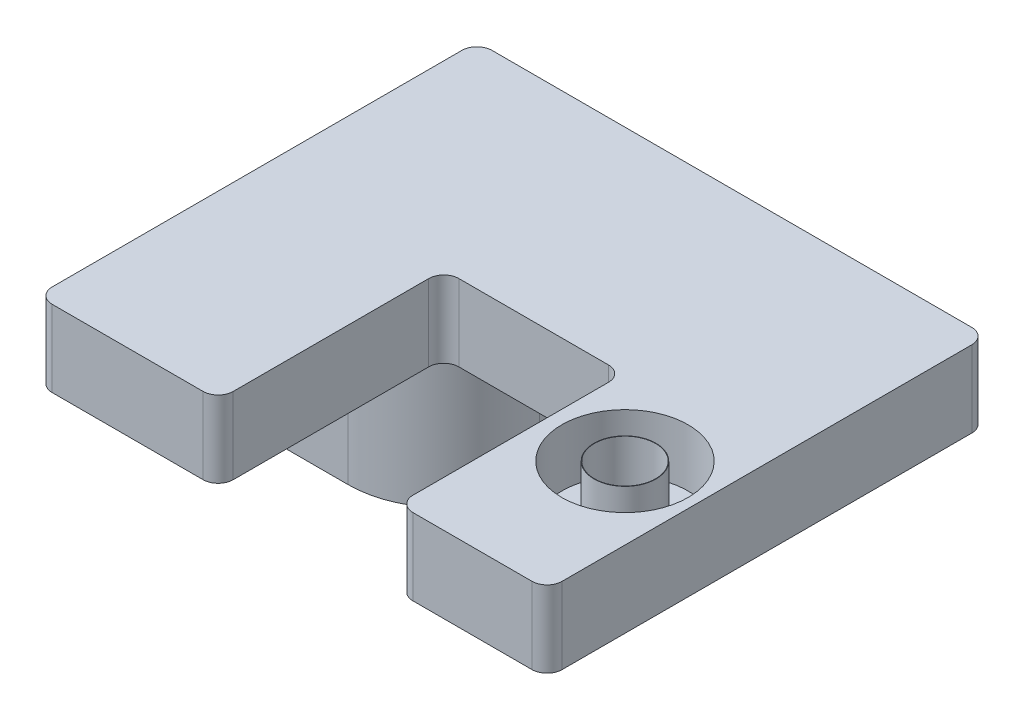
ISO-10303-21;
HEADER;
FILE_DESCRIPTION(('STEP AP214'),'2;1');
FILE_NAME('part.step','',(''),(''),'','','');
FILE_SCHEMA(('AUTOMOTIVE_DESIGN { 1 0 10303 214 1 1 1 1 }'));
ENDSEC;
DATA;
#1=APPLICATION_CONTEXT('core data for automotive mechanical design processes');
#2=APPLICATION_PROTOCOL_DEFINITION('international standard','automotive_design',2000,#1);
#3=PRODUCT_CONTEXT('',#1,'mechanical');
#4=PRODUCT('Part','Part','',(#3));
#5=PRODUCT_RELATED_PRODUCT_CATEGORY('part','',(#4));
#6=PRODUCT_DEFINITION_FORMATION('','',#4);
#7=PRODUCT_DEFINITION_CONTEXT('part definition',#1,'design');
#8=PRODUCT_DEFINITION('design','',#6,#7);
#9=PRODUCT_DEFINITION_SHAPE('','',#8);
#10=(LENGTH_UNIT() NAMED_UNIT(*) SI_UNIT(.MILLI.,.METRE.));
#11=(NAMED_UNIT(*) PLANE_ANGLE_UNIT() SI_UNIT($,.RADIAN.));
#12=(NAMED_UNIT(*) SI_UNIT($,.STERADIAN.) SOLID_ANGLE_UNIT());
#13=UNCERTAINTY_MEASURE_WITH_UNIT(LENGTH_MEASURE(1.E-05),#10,'distance_accuracy_value','');
#14=(GEOMETRIC_REPRESENTATION_CONTEXT(3) GLOBAL_UNCERTAINTY_ASSIGNED_CONTEXT((#13)) GLOBAL_UNIT_ASSIGNED_CONTEXT((#10,
#11,#12)) REPRESENTATION_CONTEXT('',''));
#15=CARTESIAN_POINT('',(0.,0.,0.));
#16=DIRECTION('',(0.,0.,1.));
#17=DIRECTION('',(1.,0.,0.));
#18=AXIS2_PLACEMENT_3D('',#15,#16,#17);
#19=CARTESIAN_POINT('',(0.,0.,0.));
#20=DIRECTION('',(0.,1.,0.));
#21=DIRECTION('',(0.,0.,1.));
#22=AXIS2_PLACEMENT_3D('',#19,#20,#21);
#23=PLANE('',#22);
#24=CARTESIAN_POINT('',(29.0406666666667,0.,-10.));
#25=DIRECTION('',(0.,1.,0.));
#26=DIRECTION('',(0.,0.,1.));
#27=AXIS2_PLACEMENT_3D('',#24,#25,#26);
#28=CIRCLE('',#27,2.032);
#29=CARTESIAN_POINT('',(29.0406666666667,0.,-7.968));
#30=VERTEX_POINT('',#29);
#31=EDGE_CURVE('E250',#30,#30,#28,.T.);
#32=ORIENTED_EDGE('',*,*,#31,.T.);
#33=EDGE_LOOP('',(#32));
#34=FACE_BOUND('',#33,.T.);
#35=DIRECTION('',(-1.,0.,0.));
#36=VECTOR('',#35,1.);
#37=CARTESIAN_POINT('',(5.96555988548007,0.,-14.6931067811865));
#38=LINE('',#37,#36);
#39=CARTESIAN_POINT('',(5.96555988548007,0.,-14.6931067811865));
#40=VERTEX_POINT('',#39);
#41=CARTESIAN_POINT('',(0.,0.,-14.6931067811865));
#42=VERTEX_POINT('',#41);
#43=EDGE_CURVE('E56',#40,#42,#38,.T.);
#44=ORIENTED_EDGE('',*,*,#43,.F.);
#45=CARTESIAN_POINT('',(5.96555988548012,0.,-21.0431067811865));
#46=DIRECTION('',(0.,-1.,0.));
#47=DIRECTION('',(0.,0.,-1.));
#48=AXIS2_PLACEMENT_3D('',#45,#46,#47);
#49=CIRCLE('',#48,6.35);
#50=CARTESIAN_POINT('',(12.3155598854801,0.,-21.0431067811866));
#51=VERTEX_POINT('',#50);
#52=EDGE_CURVE('E203',#51,#40,#49,.T.);
#53=ORIENTED_EDGE('',*,*,#52,.F.);
#54=DIRECTION('',(0.,0.,1.));
#55=VECTOR('',#54,1.);
#56=CARTESIAN_POINT('',(12.3155598854801,0.,-29.21));
#57=LINE('',#56,#55);
#58=CARTESIAN_POINT('',(12.3155598854801,0.,-29.21));
#59=VERTEX_POINT('',#58);
#60=EDGE_CURVE('E62',#59,#51,#57,.T.);
#61=ORIENTED_EDGE('',*,*,#60,.F.);
#62=DIRECTION('',(1.,0.,0.));
#63=VECTOR('',#62,1.);
#64=CARTESIAN_POINT('',(0.,0.,-29.21));
#65=LINE('',#64,#63);
#66=CARTESIAN_POINT('',(32.8666666666667,0.,-29.21));
#67=VERTEX_POINT('',#66);
#68=EDGE_CURVE('E286',#59,#67,#65,.T.);
#69=ORIENTED_EDGE('',*,*,#68,.T.);
#70=CARTESIAN_POINT('',(32.8666666666667,0.,-28.21));
#71=DIRECTION('',(0.,1.,0.));
#72=DIRECTION('',(0.,0.,1.));
#73=AXIS2_PLACEMENT_3D('',#70,#71,#72);
#74=CIRCLE('',#73,1.);
#75=CARTESIAN_POINT('',(33.8666666666667,0.,-28.21));
#76=VERTEX_POINT('',#75);
#77=EDGE_CURVE('E316',#67,#76,#74,.F.);
#78=ORIENTED_EDGE('',*,*,#77,.T.);
#79=DIRECTION('',(0.,0.,-1.));
#80=VECTOR('',#79,1.);
#81=CARTESIAN_POINT('',(33.8666666666667,0.,0.));
#82=LINE('',#81,#80);
#83=CARTESIAN_POINT('',(33.8666666666667,0.,-1.));
#84=VERTEX_POINT('',#83);
#85=EDGE_CURVE('E282',#84,#76,#82,.T.);
#86=ORIENTED_EDGE('',*,*,#85,.F.);
#87=CARTESIAN_POINT('',(32.8666666666667,0.,-1.));
#88=DIRECTION('',(0.,1.,0.));
#89=DIRECTION('',(0.,0.,1.));
#90=AXIS2_PLACEMENT_3D('',#87,#88,#89);
#91=CIRCLE('',#90,1.);
#92=CARTESIAN_POINT('',(32.8666666666667,0.,0.));
#93=VERTEX_POINT('',#92);
#94=EDGE_CURVE('E314',#84,#93,#91,.F.);
#95=ORIENTED_EDGE('',*,*,#94,.T.);
#96=DIRECTION('',(1.,0.,0.));
#97=VECTOR('',#96,1.);
#98=CARTESIAN_POINT('',(0.,0.,0.));
#99=LINE('',#98,#97);
#100=CARTESIAN_POINT('',(24.9606666666667,0.,0.));
#101=VERTEX_POINT('',#100);
#102=EDGE_CURVE('E279',#101,#93,#99,.T.);
#103=ORIENTED_EDGE('',*,*,#102,.F.);
#104=CARTESIAN_POINT('',(24.9606666666667,0.,-1.));
#105=DIRECTION('',(0.,1.,0.));
#106=DIRECTION('',(0.,0.,1.));
#107=AXIS2_PLACEMENT_3D('',#104,#105,#106);
#108=CIRCLE('',#107,1.);
#109=CARTESIAN_POINT('',(23.9606666666667,0.,-1.));
#110=VERTEX_POINT('',#109);
#111=EDGE_CURVE('E312',#101,#110,#108,.F.);
#112=ORIENTED_EDGE('',*,*,#111,.T.);
#113=DIRECTION('',(0.,0.,-1.));
#114=VECTOR('',#113,1.);
#115=CARTESIAN_POINT('',(23.9606666666667,0.,0.));
#116=LINE('',#115,#114);
#117=CARTESIAN_POINT('',(23.9606666666667,0.,-13.986));
#118=VERTEX_POINT('',#117);
#119=EDGE_CURVE('E276',#110,#118,#116,.T.);
#120=ORIENTED_EDGE('',*,*,#119,.T.);
#121=CARTESIAN_POINT('',(22.9606666666667,0.,-13.986));
#122=DIRECTION('',(0.,1.,0.));
#123=DIRECTION('',(0.,0.,1.));
#124=AXIS2_PLACEMENT_3D('',#121,#122,#123);
#125=CIRCLE('',#124,1.);
#126=CARTESIAN_POINT('',(22.9606666666667,0.,-14.986));
#127=VERTEX_POINT('',#126);
#128=EDGE_CURVE('E360',#118,#127,#125,.T.);
#129=ORIENTED_EDGE('',*,*,#128,.T.);
#130=DIRECTION('',(1.,0.,0.));
#131=VECTOR('',#130,1.);
#132=CARTESIAN_POINT('',(0.,0.,-14.986));
#133=LINE('',#132,#131);
#134=CARTESIAN_POINT('',(13.0226666666667,0.,-14.986));
#135=VERTEX_POINT('',#134);
#136=EDGE_CURVE('E255',#135,#127,#133,.T.);
#137=ORIENTED_EDGE('',*,*,#136,.F.);
#138=CARTESIAN_POINT('',(13.0226666666667,0.,-13.986));
#139=DIRECTION('',(0.,1.,0.));
#140=DIRECTION('',(0.,0.,1.));
#141=AXIS2_PLACEMENT_3D('',#138,#139,#140);
#142=CIRCLE('',#141,1.);
#143=CARTESIAN_POINT('',(12.0226666666667,0.,-13.986));
#144=VERTEX_POINT('',#143);
#145=EDGE_CURVE('E48',#135,#144,#142,.T.);
#146=ORIENTED_EDGE('',*,*,#145,.T.);
#147=DIRECTION('',(0.,0.,-1.));
#148=VECTOR('',#147,1.);
#149=CARTESIAN_POINT('',(12.0226666666667,0.,0.));
#150=LINE('',#149,#148);
#151=CARTESIAN_POINT('',(12.0226666666667,0.,-1.));
#152=VERTEX_POINT('',#151);
#153=EDGE_CURVE('E367',#152,#144,#150,.T.);
#154=ORIENTED_EDGE('',*,*,#153,.F.);
#155=CARTESIAN_POINT('',(11.0226666666667,0.,-1.));
#156=DIRECTION('',(0.,1.,0.));
#157=DIRECTION('',(0.,0.,1.));
#158=AXIS2_PLACEMENT_3D('',#155,#156,#157);
#159=CIRCLE('',#158,1.);
#160=CARTESIAN_POINT('',(11.0226666666667,0.,0.));
#161=VERTEX_POINT('',#160);
#162=EDGE_CURVE('E306',#152,#161,#159,.F.);
#163=ORIENTED_EDGE('',*,*,#162,.T.);
#164=CARTESIAN_POINT('',(1.,0.,0.));
#165=VERTEX_POINT('',#164);
#166=EDGE_CURVE('E283',#165,#161,#99,.T.);
#167=ORIENTED_EDGE('',*,*,#166,.F.);
#168=CARTESIAN_POINT('',(1.,0.,-1.));
#169=DIRECTION('',(0.,1.,0.));
#170=DIRECTION('',(0.,0.,1.));
#171=AXIS2_PLACEMENT_3D('',#168,#169,#170);
#172=CIRCLE('',#171,1.);
#173=CARTESIAN_POINT('',(0.,0.,-1.));
#174=VERTEX_POINT('',#173);
#175=EDGE_CURVE('E304',#165,#174,#172,.F.);
#176=ORIENTED_EDGE('',*,*,#175,.T.);
#177=DIRECTION('',(0.,0.,-1.));
#178=VECTOR('',#177,1.);
#179=CARTESIAN_POINT('',(0.,0.,0.));
#180=LINE('',#179,#178);
#181=EDGE_CURVE('E294',#174,#42,#180,.T.);
#182=ORIENTED_EDGE('',*,*,#181,.T.);
#183=EDGE_LOOP('',(#44,#53,#61,#69,#78,#86,#95,#103,#112,#120,#129,#137,#146,#154,#163,#167,
#176,#182));
#184=FACE_BOUND('',#183,.T.);
#185=ADVANCED_FACE('F39',(#34,#184),#23,.F.);
#186=CARTESIAN_POINT('',(0.,1.27,0.));
#187=DIRECTION('',(0.,1.,0.));
#188=DIRECTION('',(0.,0.,1.));
#189=AXIS2_PLACEMENT_3D('',#186,#187,#188);
#190=PLANE('',#189);
#191=CARTESIAN_POINT('',(29.0406666666667,1.27,-10.));
#192=DIRECTION('',(0.,1.,0.));
#193=DIRECTION('',(0.,0.,1.));
#194=AXIS2_PLACEMENT_3D('',#191,#192,#193);
#195=CIRCLE('',#194,4.191);
#196=CARTESIAN_POINT('',(29.0406666666667,1.27,-5.809));
#197=VERTEX_POINT('',#196);
#198=EDGE_CURVE('E247',#197,#197,#195,.F.);
#199=ORIENTED_EDGE('',*,*,#198,.F.);
#200=EDGE_LOOP('',(#199));
#201=FACE_BOUND('',#200,.T.);
#202=CARTESIAN_POINT('',(29.0406666666667,1.27,-10.));
#203=DIRECTION('',(0.,1.,0.));
#204=DIRECTION('',(0.,0.,1.));
#205=AXIS2_PLACEMENT_3D('',#202,#203,#204);
#206=CIRCLE('',#205,2.0574);
#207=CARTESIAN_POINT('',(29.0406666666667,1.27,-7.9426));
#208=VERTEX_POINT('',#207);
#209=EDGE_CURVE('E240',#208,#208,#206,.T.);
#210=ORIENTED_EDGE('',*,*,#209,.F.);
#211=EDGE_LOOP('',(#210));
#212=FACE_BOUND('',#211,.T.);
#213=ADVANCED_FACE('F438',(#201,#212),#190,.T.);
#214=CARTESIAN_POINT('',(29.0406666666667,5.08,-10.));
#215=DIRECTION('',(0.,-1.,0.));
#216=DIRECTION('',(0.,0.,-1.));
#217=AXIS2_PLACEMENT_3D('',#214,#215,#216);
#218=CYLINDRICAL_SURFACE('',#217,2.032);
#219=ORIENTED_EDGE('',*,*,#31,.F.);
#220=EDGE_LOOP('',(#219));
#221=FACE_BOUND('',#220,.T.);
#222=CARTESIAN_POINT('',(29.0406666666667,5.08,-10.));
#223=DIRECTION('',(0.,1.,0.));
#224=DIRECTION('',(0.,0.,1.));
#225=AXIS2_PLACEMENT_3D('',#222,#223,#224);
#226=CIRCLE('',#225,2.032);
#227=CARTESIAN_POINT('',(29.0406666666667,5.08,-7.968));
#228=VERTEX_POINT('',#227);
#229=EDGE_CURVE('E234',#228,#228,#226,.T.);
#230=ORIENTED_EDGE('',*,*,#229,.T.);
#231=EDGE_LOOP('',(#230));
#232=FACE_BOUND('',#231,.T.);
#233=ADVANCED_FACE('F444',(#221,#232),#218,.F.);
#234=CARTESIAN_POINT('',(23.9606666666667,5.08,0.));
#235=DIRECTION('',(-1.,0.,0.));
#236=DIRECTION('',(0.,0.,1.));
#237=AXIS2_PLACEMENT_3D('',#234,#235,#236);
#238=PLANE('',#237);
#239=ORIENTED_EDGE('',*,*,#119,.F.);
#240=DIRECTION('',(0.,-1.,0.));
#241=VECTOR('',#240,1.);
#242=CARTESIAN_POINT('',(23.9606666666667,5.08,-1.));
#243=LINE('',#242,#241);
#244=CARTESIAN_POINT('',(23.9606666666667,5.08,-1.));
#245=VERTEX_POINT('',#244);
#246=EDGE_CURVE('E343',#110,#245,#243,.F.);
#247=ORIENTED_EDGE('',*,*,#246,.T.);
#248=DIRECTION('',(0.,0.,-1.));
#249=VECTOR('',#248,1.);
#250=CARTESIAN_POINT('',(23.9606666666667,5.08,0.));
#251=LINE('',#250,#249);
#252=CARTESIAN_POINT('',(23.9606666666667,5.08,-13.986));
#253=VERTEX_POINT('',#252);
#254=EDGE_CURVE('E251',#245,#253,#251,.T.);
#255=ORIENTED_EDGE('',*,*,#254,.T.);
#256=DIRECTION('',(0.,-1.,0.));
#257=VECTOR('',#256,1.);
#258=CARTESIAN_POINT('',(23.9606666666667,5.08,-13.986));
#259=LINE('',#258,#257);
#260=EDGE_CURVE('E340',#253,#118,#259,.T.);
#261=ORIENTED_EDGE('',*,*,#260,.T.);
#262=EDGE_LOOP('',(#239,#247,#255,#261));
#263=FACE_BOUND('',#262,.T.);
#264=ADVANCED_FACE('F392',(#263),#238,.T.);
#265=CARTESIAN_POINT('',(0.,5.08,0.));
#266=DIRECTION('',(0.,0.,-1.));
#267=DIRECTION('',(-1.,0.,0.));
#268=AXIS2_PLACEMENT_3D('',#265,#266,#267);
#269=PLANE('',#268);
#270=ORIENTED_EDGE('',*,*,#102,.T.);
#271=DIRECTION('',(0.,-1.,0.));
#272=VECTOR('',#271,1.);
#273=CARTESIAN_POINT('',(32.8666666666667,5.08,0.));
#274=LINE('',#273,#272);
#275=CARTESIAN_POINT('',(32.8666666666667,5.08,0.));
#276=VERTEX_POINT('',#275);
#277=EDGE_CURVE('E338',#93,#276,#274,.F.);
#278=ORIENTED_EDGE('',*,*,#277,.T.);
#279=DIRECTION('',(1.,0.,0.));
#280=VECTOR('',#279,1.);
#281=CARTESIAN_POINT('',(0.,5.08,0.));
#282=LINE('',#281,#280);
#283=CARTESIAN_POINT('',(24.9606666666667,5.08,0.));
#284=VERTEX_POINT('',#283);
#285=EDGE_CURVE('E254',#284,#276,#282,.T.);
#286=ORIENTED_EDGE('',*,*,#285,.F.);
#287=DIRECTION('',(0.,-1.,0.));
#288=VECTOR('',#287,1.);
#289=CARTESIAN_POINT('',(24.9606666666667,0.,0.));
#290=LINE('',#289,#288);
#291=EDGE_CURVE('E335',#284,#101,#290,.T.);
#292=ORIENTED_EDGE('',*,*,#291,.T.);
#293=EDGE_LOOP('',(#270,#278,#286,#292));
#294=FACE_BOUND('',#293,.T.);
#295=ADVANCED_FACE('F401',(#294),#269,.F.);
#296=CARTESIAN_POINT('',(33.8666666666667,5.08,0.));
#297=DIRECTION('',(-1.,0.,0.));
#298=DIRECTION('',(0.,0.,1.));
#299=AXIS2_PLACEMENT_3D('',#296,#297,#298);
#300=PLANE('',#299);
#301=ORIENTED_EDGE('',*,*,#85,.T.);
#302=DIRECTION('',(0.,-1.,0.));
#303=VECTOR('',#302,1.);
#304=CARTESIAN_POINT('',(33.8666666666667,5.08,-28.21));
#305=LINE('',#304,#303);
#306=CARTESIAN_POINT('',(33.8666666666667,5.08,-28.21));
#307=VERTEX_POINT('',#306);
#308=EDGE_CURVE('E333',#76,#307,#305,.F.);
#309=ORIENTED_EDGE('',*,*,#308,.T.);
#310=DIRECTION('',(0.,0.,-1.));
#311=VECTOR('',#310,1.);
#312=CARTESIAN_POINT('',(33.8666666666667,5.08,0.));
#313=LINE('',#312,#311);
#314=CARTESIAN_POINT('',(33.8666666666667,5.08,-1.));
#315=VERTEX_POINT('',#314);
#316=EDGE_CURVE('E261',#315,#307,#313,.T.);
#317=ORIENTED_EDGE('',*,*,#316,.F.);
#318=DIRECTION('',(0.,-1.,0.));
#319=VECTOR('',#318,1.);
#320=CARTESIAN_POINT('',(33.8666666666667,5.08,-1.));
#321=LINE('',#320,#319);
#322=EDGE_CURVE('E330',#315,#84,#321,.T.);
#323=ORIENTED_EDGE('',*,*,#322,.T.);
#324=EDGE_LOOP('',(#301,#309,#317,#323));
#325=FACE_BOUND('',#324,.T.);
#326=ADVANCED_FACE('F410',(#325),#300,.F.);
#327=CARTESIAN_POINT('',(0.,5.08,-29.21));
#328=DIRECTION('',(0.,0.,-1.));
#329=DIRECTION('',(-1.,0.,0.));
#330=AXIS2_PLACEMENT_3D('',#327,#328,#329);
#331=PLANE('',#330);
#332=ORIENTED_EDGE('',*,*,#68,.F.);
#333=DIRECTION('',(0.,1.,0.));
#334=VECTOR('',#333,1.);
#335=CARTESIAN_POINT('',(12.3155598854801,-10.16,-29.21));
#336=LINE('',#335,#334);
#337=CARTESIAN_POINT('',(12.3155598854801,-10.16,-29.21));
#338=VERTEX_POINT('',#337);
#339=EDGE_CURVE('E193',#338,#59,#336,.T.);
#340=ORIENTED_EDGE('',*,*,#339,.F.);
#341=DIRECTION('',(1.,0.,0.));
#342=VECTOR('',#341,1.);
#343=CARTESIAN_POINT('',(0.999999999999993,-10.16,-29.21));
#344=LINE('',#343,#342);
#345=CARTESIAN_POINT('',(0.999999999999993,-10.16,-29.21));
#346=VERTEX_POINT('',#345);
#347=EDGE_CURVE('E190',#346,#338,#344,.T.);
#348=ORIENTED_EDGE('',*,*,#347,.F.);
#349=DIRECTION('',(0.,-1.,0.));
#350=VECTOR('',#349,1.);
#351=CARTESIAN_POINT('',(0.999999999999993,5.08,-29.21));
#352=LINE('',#351,#350);
#353=CARTESIAN_POINT('',(0.999999999999993,5.08,-29.21));
#354=VERTEX_POINT('',#353);
#355=EDGE_CURVE('E176',#346,#354,#352,.F.);
#356=ORIENTED_EDGE('',*,*,#355,.T.);
#357=DIRECTION('',(1.,0.,0.));
#358=VECTOR('',#357,1.);
#359=CARTESIAN_POINT('',(0.,5.08,-29.21));
#360=LINE('',#359,#358);
#361=CARTESIAN_POINT('',(32.8666666666667,5.08,-29.21));
#362=VERTEX_POINT('',#361);
#363=EDGE_CURVE('E264',#354,#362,#360,.T.);
#364=ORIENTED_EDGE('',*,*,#363,.T.);
#365=DIRECTION('',(0.,-1.,0.));
#366=VECTOR('',#365,1.);
#367=CARTESIAN_POINT('',(32.8666666666667,0.,-29.21));
#368=LINE('',#367,#366);
#369=EDGE_CURVE('E187',#362,#67,#368,.T.);
#370=ORIENTED_EDGE('',*,*,#369,.T.);
#371=EDGE_LOOP('',(#332,#340,#348,#356,#364,#370));
#372=FACE_BOUND('',#371,.T.);
#373=ADVANCED_FACE('F191',(#372),#331,.T.);
#374=CARTESIAN_POINT('',(0.,5.08,0.));
#375=DIRECTION('',(-1.,0.,0.));
#376=DIRECTION('',(0.,0.,1.));
#377=AXIS2_PLACEMENT_3D('',#374,#375,#376);
#378=PLANE('',#377);
#379=DIRECTION('',(0.,0.,-1.));
#380=VECTOR('',#379,1.);
#381=CARTESIAN_POINT('',(0.,5.08,0.));
#382=LINE('',#381,#380);
#383=CARTESIAN_POINT('',(0.,5.08,-1.));
#384=VERTEX_POINT('',#383);
#385=CARTESIAN_POINT('',(0.,5.08,-28.21));
#386=VERTEX_POINT('',#385);
#387=EDGE_CURVE('E260',#384,#386,#382,.T.);
#388=ORIENTED_EDGE('',*,*,#387,.T.);
#389=DIRECTION('',(0.,-1.,0.));
#390=VECTOR('',#389,1.);
#391=CARTESIAN_POINT('',(0.,5.08,-28.21));
#392=LINE('',#391,#390);
#393=CARTESIAN_POINT('',(0.,-10.16,-28.21));
#394=VERTEX_POINT('',#393);
#395=EDGE_CURVE('E302',#386,#394,#392,.T.);
#396=ORIENTED_EDGE('',*,*,#395,.T.);
#397=DIRECTION('',(0.,0.,-1.));
#398=VECTOR('',#397,1.);
#399=CARTESIAN_POINT('',(0.,-10.16,-14.6931067811865));
#400=LINE('',#399,#398);
#401=CARTESIAN_POINT('',(0.,-10.16,-14.6931067811865));
#402=VERTEX_POINT('',#401);
#403=EDGE_CURVE('E201',#402,#394,#400,.T.);
#404=ORIENTED_EDGE('',*,*,#403,.F.);
#405=DIRECTION('',(0.,1.,0.));
#406=VECTOR('',#405,1.);
#407=CARTESIAN_POINT('',(0.,-10.16,-14.6931067811865));
#408=LINE('',#407,#406);
#409=EDGE_CURVE('E212',#402,#42,#408,.T.);
#410=ORIENTED_EDGE('',*,*,#409,.T.);
#411=ORIENTED_EDGE('',*,*,#181,.F.);
#412=DIRECTION('',(0.,-1.,0.));
#413=VECTOR('',#412,1.);
#414=CARTESIAN_POINT('',(0.,5.08,-1.));
#415=LINE('',#414,#413);
#416=EDGE_CURVE('E273',#174,#384,#415,.F.);
#417=ORIENTED_EDGE('',*,*,#416,.T.);
#418=EDGE_LOOP('',(#388,#396,#404,#410,#411,#417));
#419=FACE_BOUND('',#418,.T.);
#420=ADVANCED_FACE('F301',(#419),#378,.T.);
#421=ORIENTED_EDGE('',*,*,#166,.T.);
#422=DIRECTION('',(0.,-1.,0.));
#423=VECTOR('',#422,1.);
#424=CARTESIAN_POINT('',(11.0226666666667,5.08,0.));
#425=LINE('',#424,#423);
#426=CARTESIAN_POINT('',(11.0226666666667,5.08,0.));
#427=VERTEX_POINT('',#426);
#428=EDGE_CURVE('E358',#161,#427,#425,.F.);
#429=ORIENTED_EDGE('',*,*,#428,.T.);
#430=CARTESIAN_POINT('',(1.,5.08,0.));
#431=VERTEX_POINT('',#430);
#432=EDGE_CURVE('E256',#431,#427,#282,.T.);
#433=ORIENTED_EDGE('',*,*,#432,.F.);
#434=DIRECTION('',(0.,-1.,0.));
#435=VECTOR('',#434,1.);
#436=CARTESIAN_POINT('',(1.,0.,0.));
#437=LINE('',#436,#435);
#438=EDGE_CURVE('E355',#431,#165,#437,.T.);
#439=ORIENTED_EDGE('',*,*,#438,.T.);
#440=EDGE_LOOP('',(#421,#429,#433,#439));
#441=FACE_BOUND('',#440,.T.);
#442=ADVANCED_FACE('F425',(#441),#269,.F.);
#443=CARTESIAN_POINT('',(12.0226666666667,5.08,0.));
#444=DIRECTION('',(-1.,0.,0.));
#445=DIRECTION('',(0.,0.,1.));
#446=AXIS2_PLACEMENT_3D('',#443,#444,#445);
#447=PLANE('',#446);
#448=ORIENTED_EDGE('',*,*,#153,.T.);
#449=DIRECTION('',(0.,-1.,0.));
#450=VECTOR('',#449,1.);
#451=CARTESIAN_POINT('',(12.0226666666667,5.08,-13.986));
#452=LINE('',#451,#450);
#453=CARTESIAN_POINT('',(12.0226666666667,5.08,-13.986));
#454=VERTEX_POINT('',#453);
#455=EDGE_CURVE('E353',#144,#454,#452,.F.);
#456=ORIENTED_EDGE('',*,*,#455,.T.);
#457=DIRECTION('',(0.,0.,-1.));
#458=VECTOR('',#457,1.);
#459=CARTESIAN_POINT('',(12.0226666666667,5.08,0.));
#460=LINE('',#459,#458);
#461=CARTESIAN_POINT('',(12.0226666666667,5.08,-1.));
#462=VERTEX_POINT('',#461);
#463=EDGE_CURVE('E259',#462,#454,#460,.T.);
#464=ORIENTED_EDGE('',*,*,#463,.F.);
#465=DIRECTION('',(0.,-1.,0.));
#466=VECTOR('',#465,1.);
#467=CARTESIAN_POINT('',(12.0226666666667,5.08,-1.));
#468=LINE('',#467,#466);
#469=EDGE_CURVE('E350',#462,#152,#468,.T.);
#470=ORIENTED_EDGE('',*,*,#469,.T.);
#471=EDGE_LOOP('',(#448,#456,#464,#470));
#472=FACE_BOUND('',#471,.T.);
#473=ADVANCED_FACE('F373',(#472),#447,.F.);
#474=CARTESIAN_POINT('',(0.,5.08,-14.986));
#475=DIRECTION('',(0.,0.,-1.));
#476=DIRECTION('',(-1.,0.,0.));
#477=AXIS2_PLACEMENT_3D('',#474,#475,#476);
#478=PLANE('',#477);
#479=ORIENTED_EDGE('',*,*,#136,.T.);
#480=DIRECTION('',(0.,-1.,0.));
#481=VECTOR('',#480,1.);
#482=CARTESIAN_POINT('',(22.9606666666667,5.08,-14.986));
#483=LINE('',#482,#481);
#484=CARTESIAN_POINT('',(22.9606666666667,5.08,-14.986));
#485=VERTEX_POINT('',#484);
#486=EDGE_CURVE('E348',#127,#485,#483,.F.);
#487=ORIENTED_EDGE('',*,*,#486,.T.);
#488=DIRECTION('',(1.,0.,0.));
#489=VECTOR('',#488,1.);
#490=CARTESIAN_POINT('',(0.,5.08,-14.986));
#491=LINE('',#490,#489);
#492=CARTESIAN_POINT('',(13.0226666666667,5.08,-14.986));
#493=VERTEX_POINT('',#492);
#494=EDGE_CURVE('E270',#493,#485,#491,.T.);
#495=ORIENTED_EDGE('',*,*,#494,.F.);
#496=DIRECTION('',(0.,-1.,0.));
#497=VECTOR('',#496,1.);
#498=CARTESIAN_POINT('',(13.0226666666667,0.,-14.986));
#499=LINE('',#498,#497);
#500=EDGE_CURVE('E345',#493,#135,#499,.T.);
#501=ORIENTED_EDGE('',*,*,#500,.T.);
#502=EDGE_LOOP('',(#479,#487,#495,#501));
#503=FACE_BOUND('',#502,.T.);
#504=ADVANCED_FACE('F383',(#503),#478,.F.);
#505=CARTESIAN_POINT('',(0.,5.08,0.));
#506=DIRECTION('',(0.,1.,0.));
#507=DIRECTION('',(0.,0.,1.));
#508=AXIS2_PLACEMENT_3D('',#505,#506,#507);
#509=PLANE('',#508);
#510=CARTESIAN_POINT('',(29.0406666666667,5.08,-10.));
#511=DIRECTION('',(0.,1.,0.));
#512=DIRECTION('',(0.,0.,1.));
#513=AXIS2_PLACEMENT_3D('',#510,#511,#512);
#514=CIRCLE('',#513,4.191);
#515=CARTESIAN_POINT('',(29.0406666666667,5.08,-5.809));
#516=VERTEX_POINT('',#515);
#517=EDGE_CURVE('E239',#516,#516,#514,.T.);
#518=ORIENTED_EDGE('',*,*,#517,.F.);
#519=EDGE_LOOP('',(#518));
#520=FACE_BOUND('',#519,.T.);
#521=ORIENTED_EDGE('',*,*,#363,.F.);
#522=CARTESIAN_POINT('',(0.999999999999993,5.08,-28.21));
#523=DIRECTION('',(0.,1.,0.));
#524=DIRECTION('',(0.,0.,1.));
#525=AXIS2_PLACEMENT_3D('',#522,#523,#524);
#526=CIRCLE('',#525,1.);
#527=EDGE_CURVE('E182',#354,#386,#526,.T.);
#528=ORIENTED_EDGE('',*,*,#527,.T.);
#529=ORIENTED_EDGE('',*,*,#387,.F.);
#530=CARTESIAN_POINT('',(1.,5.08,-1.));
#531=DIRECTION('',(0.,1.,0.));
#532=DIRECTION('',(0.,0.,1.));
#533=AXIS2_PLACEMENT_3D('',#530,#531,#532);
#534=CIRCLE('',#533,1.);
#535=EDGE_CURVE('E186',#384,#431,#534,.T.);
#536=ORIENTED_EDGE('',*,*,#535,.T.);
#537=ORIENTED_EDGE('',*,*,#432,.T.);
#538=CARTESIAN_POINT('',(11.0226666666667,5.08,-1.));
#539=DIRECTION('',(0.,1.,0.));
#540=DIRECTION('',(0.,0.,1.));
#541=AXIS2_PLACEMENT_3D('',#538,#539,#540);
#542=CIRCLE('',#541,1.);
#543=EDGE_CURVE('E321',#427,#462,#542,.T.);
#544=ORIENTED_EDGE('',*,*,#543,.T.);
#545=ORIENTED_EDGE('',*,*,#463,.T.);
#546=CARTESIAN_POINT('',(13.0226666666667,5.08,-13.986));
#547=DIRECTION('',(0.,1.,0.));
#548=DIRECTION('',(0.,0.,1.));
#549=AXIS2_PLACEMENT_3D('',#546,#547,#548);
#550=CIRCLE('',#549,1.);
#551=EDGE_CURVE('E12',#454,#493,#550,.F.);
#552=ORIENTED_EDGE('',*,*,#551,.T.);
#553=ORIENTED_EDGE('',*,*,#494,.T.);
#554=CARTESIAN_POINT('',(22.9606666666667,5.08,-13.986));
#555=DIRECTION('',(0.,1.,0.));
#556=DIRECTION('',(0.,0.,1.));
#557=AXIS2_PLACEMENT_3D('',#554,#555,#556);
#558=CIRCLE('',#557,1.);
#559=EDGE_CURVE('E362',#485,#253,#558,.F.);
#560=ORIENTED_EDGE('',*,*,#559,.T.);
#561=ORIENTED_EDGE('',*,*,#254,.F.);
#562=CARTESIAN_POINT('',(24.9606666666667,5.08,-1.));
#563=DIRECTION('',(0.,1.,0.));
#564=DIRECTION('',(0.,0.,1.));
#565=AXIS2_PLACEMENT_3D('',#562,#563,#564);
#566=CIRCLE('',#565,1.);
#567=EDGE_CURVE('E323',#245,#284,#566,.T.);
#568=ORIENTED_EDGE('',*,*,#567,.T.);
#569=ORIENTED_EDGE('',*,*,#285,.T.);
#570=CARTESIAN_POINT('',(32.8666666666667,5.08,-1.));
#571=DIRECTION('',(0.,1.,0.));
#572=DIRECTION('',(0.,0.,1.));
#573=AXIS2_PLACEMENT_3D('',#570,#571,#572);
#574=CIRCLE('',#573,1.);
#575=EDGE_CURVE('E325',#276,#315,#574,.T.);
#576=ORIENTED_EDGE('',*,*,#575,.T.);
#577=ORIENTED_EDGE('',*,*,#316,.T.);
#578=CARTESIAN_POINT('',(32.8666666666667,5.08,-28.21));
#579=DIRECTION('',(0.,1.,0.));
#580=DIRECTION('',(0.,0.,1.));
#581=AXIS2_PLACEMENT_3D('',#578,#579,#580);
#582=CIRCLE('',#581,1.);
#583=EDGE_CURVE('E327',#307,#362,#582,.T.);
#584=ORIENTED_EDGE('',*,*,#583,.T.);
#585=EDGE_LOOP('',(#521,#528,#529,#536,#537,#544,#545,#552,#553,#560,#561,#568,#569,#576,#577,#584));
#586=FACE_BOUND('',#585,.T.);
#587=ADVANCED_FACE('F380',(#520,#586),#509,.T.);
#588=CARTESIAN_POINT('',(0.999999999999993,5.08,-28.21));
#589=DIRECTION('',(0.,-1.,0.));
#590=DIRECTION('',(0.,0.,-1.));
#591=AXIS2_PLACEMENT_3D('',#588,#589,#590);
#592=CYLINDRICAL_SURFACE('',#591,1.);
#593=ORIENTED_EDGE('',*,*,#527,.F.);
#594=ORIENTED_EDGE('',*,*,#355,.F.);
#595=CARTESIAN_POINT('',(0.999999999999993,-10.16,-28.21));
#596=DIRECTION('',(0.,-1.,0.));
#597=DIRECTION('',(0.,0.,1.));
#598=AXIS2_PLACEMENT_3D('',#595,#596,#597);
#599=CIRCLE('',#598,0.999999999999991);
#600=EDGE_CURVE('E181',#394,#346,#599,.T.);
#601=ORIENTED_EDGE('',*,*,#600,.F.);
#602=ORIENTED_EDGE('',*,*,#395,.F.);
#603=EDGE_LOOP('',(#593,#594,#601,#602));
#604=FACE_BOUND('',#603,.T.);
#605=ADVANCED_FACE('F178',(#604),#592,.T.);
#606=CARTESIAN_POINT('',(32.8666666666667,5.08,-28.21));
#607=DIRECTION('',(0.,1.,0.));
#608=DIRECTION('',(0.,0.,1.));
#609=AXIS2_PLACEMENT_3D('',#606,#607,#608);
#610=CYLINDRICAL_SURFACE('',#609,1.);
#611=ORIENTED_EDGE('',*,*,#583,.F.);
#612=ORIENTED_EDGE('',*,*,#308,.F.);
#613=ORIENTED_EDGE('',*,*,#77,.F.);
#614=ORIENTED_EDGE('',*,*,#369,.F.);
#615=EDGE_LOOP('',(#611,#612,#613,#614));
#616=FACE_BOUND('',#615,.T.);
#617=ADVANCED_FACE('F415',(#616),#610,.T.);
#618=CARTESIAN_POINT('',(32.8666666666667,5.08,-1.));
#619=DIRECTION('',(0.,-1.,0.));
#620=DIRECTION('',(0.,0.,-1.));
#621=AXIS2_PLACEMENT_3D('',#618,#619,#620);
#622=CYLINDRICAL_SURFACE('',#621,1.);
#623=ORIENTED_EDGE('',*,*,#575,.F.);
#624=ORIENTED_EDGE('',*,*,#277,.F.);
#625=ORIENTED_EDGE('',*,*,#94,.F.);
#626=ORIENTED_EDGE('',*,*,#322,.F.);
#627=EDGE_LOOP('',(#623,#624,#625,#626));
#628=FACE_BOUND('',#627,.T.);
#629=ADVANCED_FACE('F405',(#628),#622,.T.);
#630=CARTESIAN_POINT('',(24.9606666666667,5.08,-1.));
#631=DIRECTION('',(0.,1.,0.));
#632=DIRECTION('',(0.,0.,1.));
#633=AXIS2_PLACEMENT_3D('',#630,#631,#632);
#634=CYLINDRICAL_SURFACE('',#633,1.);
#635=ORIENTED_EDGE('',*,*,#567,.F.);
#636=ORIENTED_EDGE('',*,*,#246,.F.);
#637=ORIENTED_EDGE('',*,*,#111,.F.);
#638=ORIENTED_EDGE('',*,*,#291,.F.);
#639=EDGE_LOOP('',(#635,#636,#637,#638));
#640=FACE_BOUND('',#639,.T.);
#641=ADVANCED_FACE('F395',(#640),#634,.T.);
#642=CARTESIAN_POINT('',(22.9606666666667,5.08,-13.986));
#643=DIRECTION('',(0.,-1.,0.));
#644=DIRECTION('',(0.,0.,-1.));
#645=AXIS2_PLACEMENT_3D('',#642,#643,#644);
#646=CYLINDRICAL_SURFACE('',#645,1.);
#647=ORIENTED_EDGE('',*,*,#559,.F.);
#648=ORIENTED_EDGE('',*,*,#486,.F.);
#649=ORIENTED_EDGE('',*,*,#128,.F.);
#650=ORIENTED_EDGE('',*,*,#260,.F.);
#651=EDGE_LOOP('',(#647,#648,#649,#650));
#652=FACE_BOUND('',#651,.T.);
#653=ADVANCED_FACE('F386',(#652),#646,.F.);
#654=CARTESIAN_POINT('',(13.0226666666667,5.08,-13.986));
#655=DIRECTION('',(0.,1.,0.));
#656=DIRECTION('',(0.,0.,1.));
#657=AXIS2_PLACEMENT_3D('',#654,#655,#656);
#658=CYLINDRICAL_SURFACE('',#657,1.);
#659=ORIENTED_EDGE('',*,*,#551,.F.);
#660=ORIENTED_EDGE('',*,*,#455,.F.);
#661=ORIENTED_EDGE('',*,*,#145,.F.);
#662=ORIENTED_EDGE('',*,*,#500,.F.);
#663=EDGE_LOOP('',(#659,#660,#661,#662));
#664=FACE_BOUND('',#663,.T.);
#665=ADVANCED_FACE('F377',(#664),#658,.F.);
#666=CARTESIAN_POINT('',(11.0226666666667,5.08,-1.));
#667=DIRECTION('',(0.,-1.,0.));
#668=DIRECTION('',(0.,0.,-1.));
#669=AXIS2_PLACEMENT_3D('',#666,#667,#668);
#670=CYLINDRICAL_SURFACE('',#669,1.);
#671=ORIENTED_EDGE('',*,*,#543,.F.);
#672=ORIENTED_EDGE('',*,*,#428,.F.);
#673=ORIENTED_EDGE('',*,*,#162,.F.);
#674=ORIENTED_EDGE('',*,*,#469,.F.);
#675=EDGE_LOOP('',(#671,#672,#673,#674));
#676=FACE_BOUND('',#675,.T.);
#677=ADVANCED_FACE('F429',(#676),#670,.T.);
#678=CARTESIAN_POINT('',(1.,5.08,-1.));
#679=DIRECTION('',(0.,1.,0.));
#680=DIRECTION('',(0.,0.,1.));
#681=AXIS2_PLACEMENT_3D('',#678,#679,#680);
#682=CYLINDRICAL_SURFACE('',#681,1.);
#683=ORIENTED_EDGE('',*,*,#535,.F.);
#684=ORIENTED_EDGE('',*,*,#416,.F.);
#685=ORIENTED_EDGE('',*,*,#175,.F.);
#686=ORIENTED_EDGE('',*,*,#438,.F.);
#687=EDGE_LOOP('',(#683,#684,#685,#686));
#688=FACE_BOUND('',#687,.T.);
#689=ADVANCED_FACE('F41',(#688),#682,.T.);
#690=CARTESIAN_POINT('',(29.0406666666667,-11.8539380798113,-10.));
#691=DIRECTION('',(0.,1.,0.));
#692=DIRECTION('',(0.,0.,1.));
#693=AXIS2_PLACEMENT_3D('',#690,#691,#692);
#694=CYLINDRICAL_SURFACE('',#693,4.191);
#695=ORIENTED_EDGE('',*,*,#198,.T.);
#696=EDGE_LOOP('',(#695));
#697=FACE_BOUND('',#696,.T.);
#698=ORIENTED_EDGE('',*,*,#517,.T.);
#699=EDGE_LOOP('',(#698));
#700=FACE_BOUND('',#699,.T.);
#701=ADVANCED_FACE('F435',(#697,#700),#694,.F.);
#702=CARTESIAN_POINT('',(29.0406666666667,10.8992059664528,-10.));
#703=DIRECTION('',(0.,-1.,0.));
#704=DIRECTION('',(0.,0.,-1.));
#705=AXIS2_PLACEMENT_3D('',#702,#703,#704);
#706=CYLINDRICAL_SURFACE('',#705,2.0574);
#707=ORIENTED_EDGE('',*,*,#209,.T.);
#708=EDGE_LOOP('',(#707));
#709=FACE_BOUND('',#708,.T.);
#710=CARTESIAN_POINT('',(29.0406666666667,5.08,-10.));
#711=DIRECTION('',(0.,1.,0.));
#712=DIRECTION('',(0.,0.,1.));
#713=AXIS2_PLACEMENT_3D('',#710,#711,#712);
#714=CIRCLE('',#713,2.0574);
#715=CARTESIAN_POINT('',(29.0406666666667,5.08,-7.9426));
#716=VERTEX_POINT('',#715);
#717=EDGE_CURVE('E236',#716,#716,#714,.T.);
#718=ORIENTED_EDGE('',*,*,#717,.F.);
#719=EDGE_LOOP('',(#718));
#720=FACE_BOUND('',#719,.T.);
#721=ADVANCED_FACE('F514',(#709,#720),#706,.T.);
#722=CARTESIAN_POINT('',(0.,5.08,0.));
#723=DIRECTION('',(0.,1.,0.));
#724=DIRECTION('',(0.,0.,1.));
#725=AXIS2_PLACEMENT_3D('',#722,#723,#724);
#726=PLANE('',#725);
#727=ORIENTED_EDGE('',*,*,#229,.F.);
#728=EDGE_LOOP('',(#727));
#729=FACE_BOUND('',#728,.T.);
#730=ORIENTED_EDGE('',*,*,#717,.T.);
#731=EDGE_LOOP('',(#730));
#732=FACE_BOUND('',#731,.T.);
#733=ADVANCED_FACE('F535',(#729,#732),#726,.T.);
#734=CARTESIAN_POINT('',(12.3155598854801,-10.16,-29.21));
#735=DIRECTION('',(-1.,0.,0.));
#736=DIRECTION('',(0.,0.,1.));
#737=AXIS2_PLACEMENT_3D('',#734,#735,#736);
#738=PLANE('',#737);
#739=ORIENTED_EDGE('',*,*,#60,.T.);
#740=DIRECTION('',(0.,1.,0.));
#741=VECTOR('',#740,1.);
#742=CARTESIAN_POINT('',(12.3155598854801,-10.16,-21.0431067811866));
#743=LINE('',#742,#741);
#744=CARTESIAN_POINT('',(12.3155598854801,-10.16,-21.0431067811866));
#745=VERTEX_POINT('',#744);
#746=EDGE_CURVE('E226',#745,#51,#743,.T.);
#747=ORIENTED_EDGE('',*,*,#746,.F.);
#748=DIRECTION('',(0.,0.,1.));
#749=VECTOR('',#748,1.);
#750=CARTESIAN_POINT('',(12.3155598854801,-10.16,-29.21));
#751=LINE('',#750,#749);
#752=EDGE_CURVE('E196',#338,#745,#751,.T.);
#753=ORIENTED_EDGE('',*,*,#752,.F.);
#754=ORIENTED_EDGE('',*,*,#339,.T.);
#755=EDGE_LOOP('',(#739,#747,#753,#754));
#756=FACE_BOUND('',#755,.T.);
#757=ADVANCED_FACE('F298',(#756),#738,.F.);
#758=CARTESIAN_POINT('',(5.96555988548012,-10.16,-21.0431067811865));
#759=DIRECTION('',(0.,1.,0.));
#760=DIRECTION('',(0.,0.,1.));
#761=AXIS2_PLACEMENT_3D('',#758,#759,#760);
#762=CYLINDRICAL_SURFACE('',#761,6.35);
#763=ORIENTED_EDGE('',*,*,#52,.T.);
#764=DIRECTION('',(0.,1.,0.));
#765=VECTOR('',#764,1.);
#766=CARTESIAN_POINT('',(5.96555988548007,-10.16,-14.6931067811865));
#767=LINE('',#766,#765);
#768=CARTESIAN_POINT('',(5.96555988548007,-10.16,-14.6931067811865));
#769=VERTEX_POINT('',#768);
#770=EDGE_CURVE('E216',#769,#40,#767,.T.);
#771=ORIENTED_EDGE('',*,*,#770,.F.);
#772=CARTESIAN_POINT('',(5.96555988548012,-10.16,-21.0431067811865));
#773=DIRECTION('',(0.,-1.,0.));
#774=DIRECTION('',(0.,0.,-1.));
#775=AXIS2_PLACEMENT_3D('',#772,#773,#774);
#776=CIRCLE('',#775,6.35);
#777=EDGE_CURVE('E207',#745,#769,#776,.T.);
#778=ORIENTED_EDGE('',*,*,#777,.F.);
#779=ORIENTED_EDGE('',*,*,#746,.T.);
#780=EDGE_LOOP('',(#763,#771,#778,#779));
#781=FACE_BOUND('',#780,.T.);
#782=ADVANCED_FACE('F299',(#781),#762,.T.);
#783=CARTESIAN_POINT('',(5.96555988548007,-10.16,-14.6931067811865));
#784=DIRECTION('',(0.,0.,-1.));
#785=DIRECTION('',(-1.,0.,0.));
#786=AXIS2_PLACEMENT_3D('',#783,#784,#785);
#787=PLANE('',#786);
#788=ORIENTED_EDGE('',*,*,#43,.T.);
#789=ORIENTED_EDGE('',*,*,#409,.F.);
#790=DIRECTION('',(-1.,0.,0.));
#791=VECTOR('',#790,1.);
#792=CARTESIAN_POINT('',(5.96555988548007,-10.16,-14.6931067811865));
#793=LINE('',#792,#791);
#794=EDGE_CURVE('E209',#769,#402,#793,.T.);
#795=ORIENTED_EDGE('',*,*,#794,.F.);
#796=ORIENTED_EDGE('',*,*,#770,.T.);
#797=EDGE_LOOP('',(#788,#789,#795,#796));
#798=FACE_BOUND('',#797,.T.);
#799=ADVANCED_FACE('F300',(#798),#787,.F.);
#800=CARTESIAN_POINT('',(0.999999999999993,-10.16,-28.21));
#801=DIRECTION('',(0.,1.,0.));
#802=DIRECTION('',(0.,0.,1.));
#803=AXIS2_PLACEMENT_3D('',#800,#801,#802);
#804=PLANE('',#803);
#805=ORIENTED_EDGE('',*,*,#600,.T.);
#806=ORIENTED_EDGE('',*,*,#347,.T.);
#807=ORIENTED_EDGE('',*,*,#752,.T.);
#808=ORIENTED_EDGE('',*,*,#777,.T.);
#809=ORIENTED_EDGE('',*,*,#794,.T.);
#810=ORIENTED_EDGE('',*,*,#403,.T.);
#811=EDGE_LOOP('',(#805,#806,#807,#808,#809,#810));
#812=FACE_BOUND('',#811,.T.);
#813=ADVANCED_FACE('F199',(#812),#804,.F.);
#814=CLOSED_SHELL('',(#185,#213,#233,#264,#295,#326,#373,#420,#442,#473,#504,#587,#605,#617,
#629,#641,#653,#665,#677,#689,#701,#721,#733,#757,#782,#799,#813));
#815=MANIFOLD_SOLID_BREP('B2',#814);
#816=ADVANCED_BREP_SHAPE_REPRESENTATION('',(#18,#815),#14);
#817=SHAPE_DEFINITION_REPRESENTATION(#9,#816);
ENDSEC;
END-ISO-10303-21;
